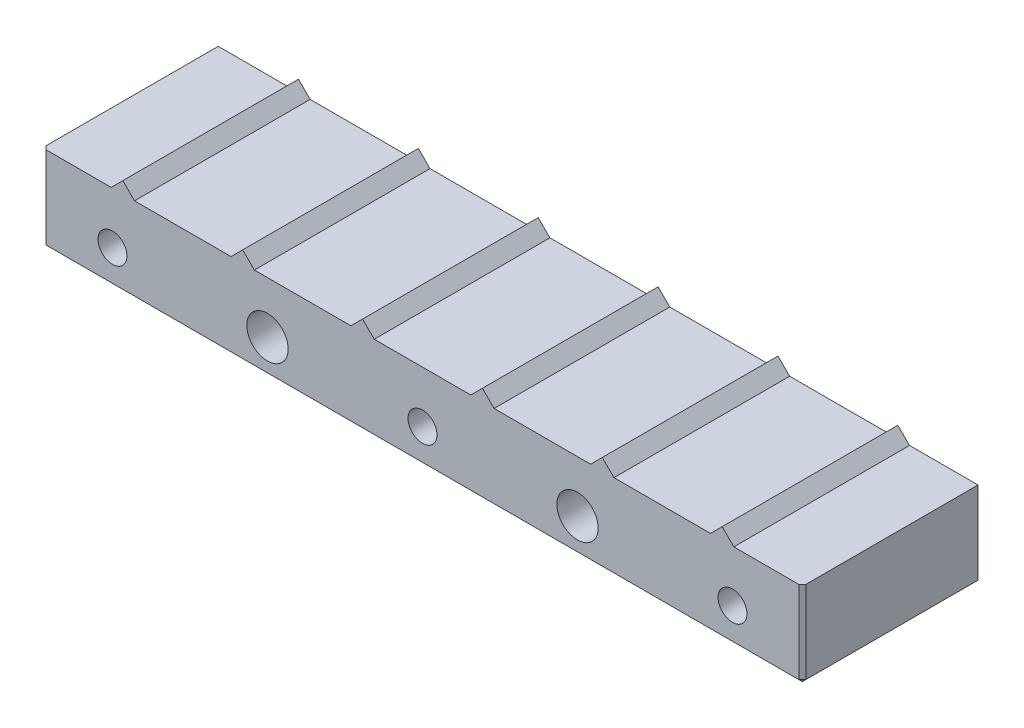
ISO-10303-21;
HEADER;
FILE_DESCRIPTION(('STEP AP214'),'2;1');
FILE_NAME('part.step','',(''),(''),'','','');
FILE_SCHEMA(('AUTOMOTIVE_DESIGN { 1 0 10303 214 1 1 1 1 }'));
ENDSEC;
DATA;
#1=APPLICATION_CONTEXT('core data for automotive mechanical design processes');
#2=APPLICATION_PROTOCOL_DEFINITION('international standard','automotive_design',2000,#1);
#3=PRODUCT_CONTEXT('',#1,'mechanical');
#4=PRODUCT('Part','Part','',(#3));
#5=PRODUCT_RELATED_PRODUCT_CATEGORY('part','',(#4));
#6=PRODUCT_DEFINITION_FORMATION('','',#4);
#7=PRODUCT_DEFINITION_CONTEXT('part definition',#1,'design');
#8=PRODUCT_DEFINITION('design','',#6,#7);
#9=PRODUCT_DEFINITION_SHAPE('','',#8);
#10=(LENGTH_UNIT() NAMED_UNIT(*) SI_UNIT(.MILLI.,.METRE.));
#11=(NAMED_UNIT(*) PLANE_ANGLE_UNIT() SI_UNIT($,.RADIAN.));
#12=(NAMED_UNIT(*) SI_UNIT($,.STERADIAN.) SOLID_ANGLE_UNIT());
#13=UNCERTAINTY_MEASURE_WITH_UNIT(LENGTH_MEASURE(1.E-05),#10,'distance_accuracy_value','');
#14=(GEOMETRIC_REPRESENTATION_CONTEXT(3) GLOBAL_UNCERTAINTY_ASSIGNED_CONTEXT((#13)) GLOBAL_UNIT_ASSIGNED_CONTEXT((#10,
#11,#12)) REPRESENTATION_CONTEXT('',''));
#15=CARTESIAN_POINT('',(0.,0.,0.));
#16=DIRECTION('',(0.,0.,1.));
#17=DIRECTION('',(1.,0.,0.));
#18=AXIS2_PLACEMENT_3D('',#15,#16,#17);
#19=CARTESIAN_POINT('',(9.95621320343559,12.475,-25.5));
#20=DIRECTION('',(0.70710678118633,-0.707106781186765,0.));
#21=DIRECTION('',(0.707106781186765,0.70710678118633,0.));
#22=AXIS2_PLACEMENT_3D('',#19,#20,#21);
#23=PLANE('',#22);
#24=DIRECTION('',(0.707106781186765,0.70710678118633,0.));
#25=VECTOR('',#24,1.);
#26=CARTESIAN_POINT('',(9.95621320343559,12.475,0.));
#27=LINE('',#26,#25);
#28=CARTESIAN_POINT('',(9.95621320343559,12.475,0.));
#29=VERTEX_POINT('',#28);
#30=CARTESIAN_POINT('',(11.6500000000008,14.1687867965642,0.));
#31=VERTEX_POINT('',#30);
#32=EDGE_CURVE('E245',#29,#31,#27,.T.);
#33=ORIENTED_EDGE('',*,*,#32,.T.);
#34=DIRECTION('',(0.,0.,1.));
#35=VECTOR('',#34,1.);
#36=CARTESIAN_POINT('',(11.6500000000008,14.1687867965642,-25.5));
#37=LINE('',#36,#35);
#38=CARTESIAN_POINT('',(11.6500000000008,14.1687867965642,-25.5));
#39=VERTEX_POINT('',#38);
#40=EDGE_CURVE('E226',#39,#31,#37,.T.);
#41=ORIENTED_EDGE('',*,*,#40,.F.);
#42=DIRECTION('',(0.707106781186765,0.70710678118633,0.));
#43=VECTOR('',#42,1.);
#44=CARTESIAN_POINT('',(9.95621320343559,12.475,-25.5));
#45=LINE('',#44,#43);
#46=CARTESIAN_POINT('',(9.95621320343559,12.475,-25.5));
#47=VERTEX_POINT('',#46);
#48=EDGE_CURVE('E233',#47,#39,#45,.T.);
#49=ORIENTED_EDGE('',*,*,#48,.F.);
#50=DIRECTION('',(0.,0.,1.));
#51=VECTOR('',#50,1.);
#52=CARTESIAN_POINT('',(9.95621320343559,12.475,-25.5));
#53=LINE('',#52,#51);
#54=EDGE_CURVE('E367',#47,#29,#53,.T.);
#55=ORIENTED_EDGE('',*,*,#54,.T.);
#56=EDGE_LOOP('',(#33,#41,#49,#55));
#57=FACE_BOUND('',#56,.T.);
#58=ADVANCED_FACE('F49',(#57),#23,.F.);
#59=CARTESIAN_POINT('',(11.6500000000008,14.1687867965642,-25.5));
#60=DIRECTION('',(-0.70710678118633,-0.707106781186765,0.));
#61=DIRECTION('',(0.707106781186765,-0.70710678118633,0.));
#62=AXIS2_PLACEMENT_3D('',#59,#60,#61);
#63=PLANE('',#62);
#64=DIRECTION('',(0.707106781186765,-0.70710678118633,0.));
#65=VECTOR('',#64,1.);
#66=CARTESIAN_POINT('',(11.6500000000008,14.1687867965642,0.));
#67=LINE('',#66,#65);
#68=CARTESIAN_POINT('',(13.343786796566,12.475,0.));
#69=VERTEX_POINT('',#68);
#70=EDGE_CURVE('E369',#31,#69,#67,.T.);
#71=ORIENTED_EDGE('',*,*,#70,.T.);
#72=DIRECTION('',(0.,0.,1.));
#73=VECTOR('',#72,1.);
#74=CARTESIAN_POINT('',(13.343786796566,12.475,-25.5));
#75=LINE('',#74,#73);
#76=CARTESIAN_POINT('',(13.343786796566,12.475,-25.5));
#77=VERTEX_POINT('',#76);
#78=EDGE_CURVE('E229',#77,#69,#75,.T.);
#79=ORIENTED_EDGE('',*,*,#78,.F.);
#80=DIRECTION('',(0.707106781186765,-0.70710678118633,0.));
#81=VECTOR('',#80,1.);
#82=CARTESIAN_POINT('',(11.6500000000008,14.1687867965642,-25.5));
#83=LINE('',#82,#81);
#84=EDGE_CURVE('E222',#39,#77,#83,.T.);
#85=ORIENTED_EDGE('',*,*,#84,.F.);
#86=ORIENTED_EDGE('',*,*,#40,.T.);
#87=EDGE_LOOP('',(#71,#79,#85,#86));
#88=FACE_BOUND('',#87,.T.);
#89=ADVANCED_FACE('F224',(#88),#63,.F.);
#90=CARTESIAN_POINT('',(13.343786796566,12.475,-25.5));
#91=DIRECTION('',(0.,-1.,0.));
#92=DIRECTION('',(0.,0.,-1.));
#93=AXIS2_PLACEMENT_3D('',#90,#91,#92);
#94=PLANE('',#93);
#95=DIRECTION('',(1.,0.,0.));
#96=VECTOR('',#95,1.);
#97=CARTESIAN_POINT('',(13.343786796566,12.475,0.));
#98=LINE('',#97,#96);
#99=CARTESIAN_POINT('',(27.356213203437,12.475,0.));
#100=VERTEX_POINT('',#99);
#101=EDGE_CURVE('E371',#69,#100,#98,.T.);
#102=ORIENTED_EDGE('',*,*,#101,.T.);
#103=DIRECTION('',(0.,0.,1.));
#104=VECTOR('',#103,1.);
#105=CARTESIAN_POINT('',(27.356213203437,12.475,-25.5));
#106=LINE('',#105,#104);
#107=CARTESIAN_POINT('',(27.356213203437,12.475,-25.5));
#108=VERTEX_POINT('',#107);
#109=EDGE_CURVE('E250',#108,#100,#106,.T.);
#110=ORIENTED_EDGE('',*,*,#109,.F.);
#111=DIRECTION('',(1.,0.,0.));
#112=VECTOR('',#111,1.);
#113=CARTESIAN_POINT('',(13.343786796566,12.475,-25.5));
#114=LINE('',#113,#112);
#115=EDGE_CURVE('E232',#77,#108,#114,.T.);
#116=ORIENTED_EDGE('',*,*,#115,.F.);
#117=ORIENTED_EDGE('',*,*,#78,.T.);
#118=EDGE_LOOP('',(#102,#110,#116,#117));
#119=FACE_BOUND('',#118,.T.);
#120=ADVANCED_FACE('F476',(#119),#94,.F.);
#121=CARTESIAN_POINT('',(27.356213203437,12.475,-25.5));
#122=DIRECTION('',(0.70710678118633,-0.707106781186765,0.));
#123=DIRECTION('',(0.707106781186765,0.70710678118633,0.));
#124=AXIS2_PLACEMENT_3D('',#121,#122,#123);
#125=PLANE('',#124);
#126=DIRECTION('',(0.707106781186765,0.70710678118633,0.));
#127=VECTOR('',#126,1.);
#128=CARTESIAN_POINT('',(27.356213203437,12.475,0.));
#129=LINE('',#128,#127);
#130=CARTESIAN_POINT('',(29.0500000000022,14.1687867965642,0.));
#131=VERTEX_POINT('',#130);
#132=EDGE_CURVE('E373',#100,#131,#129,.T.);
#133=ORIENTED_EDGE('',*,*,#132,.T.);
#134=DIRECTION('',(0.,0.,1.));
#135=VECTOR('',#134,1.);
#136=CARTESIAN_POINT('',(29.0500000000022,14.1687867965642,-25.5));
#137=LINE('',#136,#135);
#138=CARTESIAN_POINT('',(29.0500000000022,14.1687867965642,-25.5));
#139=VERTEX_POINT('',#138);
#140=EDGE_CURVE('E451',#139,#131,#137,.T.);
#141=ORIENTED_EDGE('',*,*,#140,.F.);
#142=DIRECTION('',(0.707106781186765,0.70710678118633,0.));
#143=VECTOR('',#142,1.);
#144=CARTESIAN_POINT('',(27.356213203437,12.475,-25.5));
#145=LINE('',#144,#143);
#146=EDGE_CURVE('E332',#108,#139,#145,.T.);
#147=ORIENTED_EDGE('',*,*,#146,.F.);
#148=ORIENTED_EDGE('',*,*,#109,.T.);
#149=EDGE_LOOP('',(#133,#141,#147,#148));
#150=FACE_BOUND('',#149,.T.);
#151=ADVANCED_FACE('F458',(#150),#125,.F.);
#152=CARTESIAN_POINT('',(29.0500000000022,14.1687867965642,-25.5));
#153=DIRECTION('',(-0.70710678118633,-0.707106781186765,0.));
#154=DIRECTION('',(0.707106781186765,-0.70710678118633,0.));
#155=AXIS2_PLACEMENT_3D('',#152,#153,#154);
#156=PLANE('',#155);
#157=DIRECTION('',(0.707106781186765,-0.70710678118633,0.));
#158=VECTOR('',#157,1.);
#159=CARTESIAN_POINT('',(29.0500000000022,14.1687867965642,0.));
#160=LINE('',#159,#158);
#161=CARTESIAN_POINT('',(30.7437867965674,12.475,0.));
#162=VERTEX_POINT('',#161);
#163=EDGE_CURVE('E375',#131,#162,#160,.T.);
#164=ORIENTED_EDGE('',*,*,#163,.T.);
#165=DIRECTION('',(0.,0.,1.));
#166=VECTOR('',#165,1.);
#167=CARTESIAN_POINT('',(30.7437867965674,12.475,-25.5));
#168=LINE('',#167,#166);
#169=CARTESIAN_POINT('',(30.7437867965674,12.475,-25.5));
#170=VERTEX_POINT('',#169);
#171=EDGE_CURVE('E448',#170,#162,#168,.T.);
#172=ORIENTED_EDGE('',*,*,#171,.F.);
#173=DIRECTION('',(0.707106781186765,-0.70710678118633,0.));
#174=VECTOR('',#173,1.);
#175=CARTESIAN_POINT('',(29.0500000000022,14.1687867965642,-25.5));
#176=LINE('',#175,#174);
#177=EDGE_CURVE('E334',#139,#170,#176,.T.);
#178=ORIENTED_EDGE('',*,*,#177,.F.);
#179=ORIENTED_EDGE('',*,*,#140,.T.);
#180=EDGE_LOOP('',(#164,#172,#178,#179));
#181=FACE_BOUND('',#180,.T.);
#182=ADVANCED_FACE('F468',(#181),#156,.F.);
#183=CARTESIAN_POINT('',(30.7437867965674,12.475,-25.5));
#184=DIRECTION('',(0.,-1.,0.));
#185=DIRECTION('',(0.,0.,-1.));
#186=AXIS2_PLACEMENT_3D('',#183,#184,#185);
#187=PLANE('',#186);
#188=DIRECTION('',(1.,0.,0.));
#189=VECTOR('',#188,1.);
#190=CARTESIAN_POINT('',(30.7437867965674,12.475,0.));
#191=LINE('',#190,#189);
#192=CARTESIAN_POINT('',(44.7562132034383,12.475,0.));
#193=VERTEX_POINT('',#192);
#194=EDGE_CURVE('E377',#162,#193,#191,.T.);
#195=ORIENTED_EDGE('',*,*,#194,.T.);
#196=DIRECTION('',(0.,0.,1.));
#197=VECTOR('',#196,1.);
#198=CARTESIAN_POINT('',(44.7562132034383,12.475,-25.5));
#199=LINE('',#198,#197);
#200=CARTESIAN_POINT('',(44.7562132034383,12.475,-25.5));
#201=VERTEX_POINT('',#200);
#202=EDGE_CURVE('E445',#201,#193,#199,.T.);
#203=ORIENTED_EDGE('',*,*,#202,.F.);
#204=DIRECTION('',(1.,0.,0.));
#205=VECTOR('',#204,1.);
#206=CARTESIAN_POINT('',(30.7437867965674,12.475,-25.5));
#207=LINE('',#206,#205);
#208=EDGE_CURVE('E336',#170,#201,#207,.T.);
#209=ORIENTED_EDGE('',*,*,#208,.F.);
#210=ORIENTED_EDGE('',*,*,#171,.T.);
#211=EDGE_LOOP('',(#195,#203,#209,#210));
#212=FACE_BOUND('',#211,.T.);
#213=ADVANCED_FACE('F472',(#212),#187,.F.);
#214=CARTESIAN_POINT('',(44.7562132034383,12.475,-25.5));
#215=DIRECTION('',(0.70710678118633,-0.707106781186765,0.));
#216=DIRECTION('',(0.707106781186765,0.70710678118633,0.));
#217=AXIS2_PLACEMENT_3D('',#214,#215,#216);
#218=PLANE('',#217);
#219=DIRECTION('',(0.707106781186765,0.70710678118633,0.));
#220=VECTOR('',#219,1.);
#221=CARTESIAN_POINT('',(44.7562132034383,12.475,0.));
#222=LINE('',#221,#220);
#223=CARTESIAN_POINT('',(46.4500000000035,14.1687867965642,0.));
#224=VERTEX_POINT('',#223);
#225=EDGE_CURVE('E379',#193,#224,#222,.T.);
#226=ORIENTED_EDGE('',*,*,#225,.T.);
#227=DIRECTION('',(0.,0.,1.));
#228=VECTOR('',#227,1.);
#229=CARTESIAN_POINT('',(46.4500000000035,14.1687867965642,-25.5));
#230=LINE('',#229,#228);
#231=CARTESIAN_POINT('',(46.4500000000035,14.1687867965642,-25.5));
#232=VERTEX_POINT('',#231);
#233=EDGE_CURVE('E442',#232,#224,#230,.T.);
#234=ORIENTED_EDGE('',*,*,#233,.F.);
#235=DIRECTION('',(0.707106781186765,0.70710678118633,0.));
#236=VECTOR('',#235,1.);
#237=CARTESIAN_POINT('',(44.7562132034383,12.475,-25.5));
#238=LINE('',#237,#236);
#239=EDGE_CURVE('E338',#201,#232,#238,.T.);
#240=ORIENTED_EDGE('',*,*,#239,.F.);
#241=ORIENTED_EDGE('',*,*,#202,.T.);
#242=EDGE_LOOP('',(#226,#234,#240,#241));
#243=FACE_BOUND('',#242,.T.);
#244=ADVANCED_FACE('F583',(#243),#218,.F.);
#245=CARTESIAN_POINT('',(46.4500000000035,14.1687867965642,-25.5));
#246=DIRECTION('',(-0.70710678118633,-0.707106781186765,0.));
#247=DIRECTION('',(0.707106781186765,-0.70710678118633,0.));
#248=AXIS2_PLACEMENT_3D('',#245,#246,#247);
#249=PLANE('',#248);
#250=DIRECTION('',(0.707106781186765,-0.70710678118633,0.));
#251=VECTOR('',#250,1.);
#252=CARTESIAN_POINT('',(46.4500000000035,14.1687867965642,0.));
#253=LINE('',#252,#251);
#254=CARTESIAN_POINT('',(48.1437867965688,12.475,0.));
#255=VERTEX_POINT('',#254);
#256=EDGE_CURVE('E381',#224,#255,#253,.T.);
#257=ORIENTED_EDGE('',*,*,#256,.T.);
#258=DIRECTION('',(0.,0.,1.));
#259=VECTOR('',#258,1.);
#260=CARTESIAN_POINT('',(48.1437867965688,12.475,-25.5));
#261=LINE('',#260,#259);
#262=CARTESIAN_POINT('',(48.1437867965688,12.475,-25.5));
#263=VERTEX_POINT('',#262);
#264=EDGE_CURVE('E439',#263,#255,#261,.T.);
#265=ORIENTED_EDGE('',*,*,#264,.F.);
#266=DIRECTION('',(0.707106781186765,-0.70710678118633,0.));
#267=VECTOR('',#266,1.);
#268=CARTESIAN_POINT('',(46.4500000000035,14.1687867965642,-25.5));
#269=LINE('',#268,#267);
#270=EDGE_CURVE('E340',#232,#263,#269,.T.);
#271=ORIENTED_EDGE('',*,*,#270,.F.);
#272=ORIENTED_EDGE('',*,*,#233,.T.);
#273=EDGE_LOOP('',(#257,#265,#271,#272));
#274=FACE_BOUND('',#273,.T.);
#275=ADVANCED_FACE('F581',(#274),#249,.F.);
#276=CARTESIAN_POINT('',(48.1437867965688,12.475,-25.5));
#277=DIRECTION('',(0.,-1.,0.));
#278=DIRECTION('',(1.,0.,0.));
#279=AXIS2_PLACEMENT_3D('',#276,#277,#278);
#280=PLANE('',#279);
#281=DIRECTION('',(1.,0.,0.));
#282=VECTOR('',#281,1.);
#283=CARTESIAN_POINT('',(48.1437867965688,12.475,0.));
#284=LINE('',#283,#282);
#285=CARTESIAN_POINT('',(62.1562132034397,12.475,0.));
#286=VERTEX_POINT('',#285);
#287=EDGE_CURVE('E383',#255,#286,#284,.T.);
#288=ORIENTED_EDGE('',*,*,#287,.T.);
#289=DIRECTION('',(0.,0.,1.));
#290=VECTOR('',#289,1.);
#291=CARTESIAN_POINT('',(62.1562132034397,12.475,-25.5));
#292=LINE('',#291,#290);
#293=CARTESIAN_POINT('',(62.1562132034397,12.475,-25.5));
#294=VERTEX_POINT('',#293);
#295=EDGE_CURVE('E436',#294,#286,#292,.T.);
#296=ORIENTED_EDGE('',*,*,#295,.F.);
#297=DIRECTION('',(1.,0.,0.));
#298=VECTOR('',#297,1.);
#299=CARTESIAN_POINT('',(48.1437867965688,12.475,-25.5));
#300=LINE('',#299,#298);
#301=EDGE_CURVE('E342',#263,#294,#300,.T.);
#302=ORIENTED_EDGE('',*,*,#301,.F.);
#303=ORIENTED_EDGE('',*,*,#264,.T.);
#304=EDGE_LOOP('',(#288,#296,#302,#303));
#305=FACE_BOUND('',#304,.T.);
#306=ADVANCED_FACE('F577',(#305),#280,.F.);
#307=CARTESIAN_POINT('',(62.1562132034397,12.475,-25.5));
#308=DIRECTION('',(0.707106781186331,-0.707106781186764,0.));
#309=DIRECTION('',(0.707106781186764,0.707106781186331,0.));
#310=AXIS2_PLACEMENT_3D('',#307,#308,#309);
#311=PLANE('',#310);
#312=DIRECTION('',(0.707106781186764,0.707106781186331,0.));
#313=VECTOR('',#312,1.);
#314=CARTESIAN_POINT('',(62.1562132034397,12.475,0.));
#315=LINE('',#314,#313);
#316=CARTESIAN_POINT('',(63.8500000000049,14.1687867965642,0.));
#317=VERTEX_POINT('',#316);
#318=EDGE_CURVE('E385',#286,#317,#315,.T.);
#319=ORIENTED_EDGE('',*,*,#318,.T.);
#320=DIRECTION('',(0.,0.,1.));
#321=VECTOR('',#320,1.);
#322=CARTESIAN_POINT('',(63.8500000000049,14.1687867965642,-25.5));
#323=LINE('',#322,#321);
#324=CARTESIAN_POINT('',(63.8500000000049,14.1687867965642,-25.5));
#325=VERTEX_POINT('',#324);
#326=EDGE_CURVE('E433',#325,#317,#323,.T.);
#327=ORIENTED_EDGE('',*,*,#326,.F.);
#328=DIRECTION('',(0.707106781186764,0.707106781186331,0.));
#329=VECTOR('',#328,1.);
#330=CARTESIAN_POINT('',(62.1562132034397,12.475,-25.5));
#331=LINE('',#330,#329);
#332=EDGE_CURVE('E344',#294,#325,#331,.T.);
#333=ORIENTED_EDGE('',*,*,#332,.F.);
#334=ORIENTED_EDGE('',*,*,#295,.T.);
#335=EDGE_LOOP('',(#319,#327,#333,#334));
#336=FACE_BOUND('',#335,.T.);
#337=ADVANCED_FACE('F572',(#336),#311,.F.);
#338=CARTESIAN_POINT('',(63.8500000000049,14.1687867965642,-25.5));
#339=DIRECTION('',(-0.70710678118633,-0.707106781186765,0.));
#340=DIRECTION('',(0.707106781186765,-0.70710678118633,0.));
#341=AXIS2_PLACEMENT_3D('',#338,#339,#340);
#342=PLANE('',#341);
#343=DIRECTION('',(0.707106781186765,-0.70710678118633,0.));
#344=VECTOR('',#343,1.);
#345=CARTESIAN_POINT('',(63.8500000000049,14.1687867965642,0.));
#346=LINE('',#345,#344);
#347=CARTESIAN_POINT('',(65.5437867965701,12.475,0.));
#348=VERTEX_POINT('',#347);
#349=EDGE_CURVE('E387',#317,#348,#346,.T.);
#350=ORIENTED_EDGE('',*,*,#349,.T.);
#351=DIRECTION('',(0.,0.,1.));
#352=VECTOR('',#351,1.);
#353=CARTESIAN_POINT('',(65.5437867965701,12.475,-25.5));
#354=LINE('',#353,#352);
#355=CARTESIAN_POINT('',(65.5437867965701,12.475,-25.5));
#356=VERTEX_POINT('',#355);
#357=EDGE_CURVE('E430',#356,#348,#354,.T.);
#358=ORIENTED_EDGE('',*,*,#357,.F.);
#359=DIRECTION('',(0.707106781186765,-0.70710678118633,0.));
#360=VECTOR('',#359,1.);
#361=CARTESIAN_POINT('',(63.8500000000049,14.1687867965642,-25.5));
#362=LINE('',#361,#360);
#363=EDGE_CURVE('E346',#325,#356,#362,.T.);
#364=ORIENTED_EDGE('',*,*,#363,.F.);
#365=ORIENTED_EDGE('',*,*,#326,.T.);
#366=EDGE_LOOP('',(#350,#358,#364,#365));
#367=FACE_BOUND('',#366,.T.);
#368=ADVANCED_FACE('F566',(#367),#342,.F.);
#369=CARTESIAN_POINT('',(65.5437867965701,12.475,-25.5));
#370=DIRECTION('',(0.,-1.,0.));
#371=DIRECTION('',(1.,0.,0.));
#372=AXIS2_PLACEMENT_3D('',#369,#370,#371);
#373=PLANE('',#372);
#374=DIRECTION('',(1.,0.,0.));
#375=VECTOR('',#374,1.);
#376=CARTESIAN_POINT('',(65.5437867965701,12.475,0.));
#377=LINE('',#376,#375);
#378=CARTESIAN_POINT('',(79.5562132034411,12.475,0.));
#379=VERTEX_POINT('',#378);
#380=EDGE_CURVE('E389',#348,#379,#377,.T.);
#381=ORIENTED_EDGE('',*,*,#380,.T.);
#382=DIRECTION('',(0.,0.,1.));
#383=VECTOR('',#382,1.);
#384=CARTESIAN_POINT('',(79.5562132034411,12.475,-25.5));
#385=LINE('',#384,#383);
#386=CARTESIAN_POINT('',(79.5562132034411,12.475,-25.5));
#387=VERTEX_POINT('',#386);
#388=EDGE_CURVE('E427',#387,#379,#385,.T.);
#389=ORIENTED_EDGE('',*,*,#388,.F.);
#390=DIRECTION('',(1.,0.,0.));
#391=VECTOR('',#390,1.);
#392=CARTESIAN_POINT('',(65.5437867965701,12.475,-25.5));
#393=LINE('',#392,#391);
#394=EDGE_CURVE('E348',#356,#387,#393,.T.);
#395=ORIENTED_EDGE('',*,*,#394,.F.);
#396=ORIENTED_EDGE('',*,*,#357,.T.);
#397=EDGE_LOOP('',(#381,#389,#395,#396));
#398=FACE_BOUND('',#397,.T.);
#399=ADVANCED_FACE('F562',(#398),#373,.F.);
#400=CARTESIAN_POINT('',(79.5562132034411,12.475,-25.5));
#401=DIRECTION('',(0.707106781186331,-0.707106781186764,0.));
#402=DIRECTION('',(0.707106781186764,0.707106781186331,0.));
#403=AXIS2_PLACEMENT_3D('',#400,#401,#402);
#404=PLANE('',#403);
#405=DIRECTION('',(0.707106781186764,0.707106781186331,0.));
#406=VECTOR('',#405,1.);
#407=CARTESIAN_POINT('',(79.5562132034411,12.475,0.));
#408=LINE('',#407,#406);
#409=CARTESIAN_POINT('',(81.2500000000063,14.1687867965642,0.));
#410=VERTEX_POINT('',#409);
#411=EDGE_CURVE('E391',#379,#410,#408,.T.);
#412=ORIENTED_EDGE('',*,*,#411,.T.);
#413=DIRECTION('',(0.,0.,1.));
#414=VECTOR('',#413,1.);
#415=CARTESIAN_POINT('',(81.2500000000063,14.1687867965642,-25.5));
#416=LINE('',#415,#414);
#417=CARTESIAN_POINT('',(81.2500000000063,14.1687867965642,-25.5));
#418=VERTEX_POINT('',#417);
#419=EDGE_CURVE('E424',#418,#410,#416,.T.);
#420=ORIENTED_EDGE('',*,*,#419,.F.);
#421=DIRECTION('',(0.707106781186764,0.707106781186331,0.));
#422=VECTOR('',#421,1.);
#423=CARTESIAN_POINT('',(79.5562132034411,12.475,-25.5));
#424=LINE('',#423,#422);
#425=EDGE_CURVE('E350',#387,#418,#424,.T.);
#426=ORIENTED_EDGE('',*,*,#425,.F.);
#427=ORIENTED_EDGE('',*,*,#388,.T.);
#428=EDGE_LOOP('',(#412,#420,#426,#427));
#429=FACE_BOUND('',#428,.T.);
#430=ADVANCED_FACE('F557',(#429),#404,.F.);
#431=CARTESIAN_POINT('',(81.2500000000063,14.1687867965642,-25.5));
#432=DIRECTION('',(-0.70710678118633,-0.707106781186765,0.));
#433=DIRECTION('',(0.707106781186765,-0.70710678118633,0.));
#434=AXIS2_PLACEMENT_3D('',#431,#432,#433);
#435=PLANE('',#434);
#436=DIRECTION('',(0.707106781186765,-0.70710678118633,0.));
#437=VECTOR('',#436,1.);
#438=CARTESIAN_POINT('',(81.2500000000063,14.1687867965642,0.));
#439=LINE('',#438,#437);
#440=CARTESIAN_POINT('',(82.9437867965715,12.475,0.));
#441=VERTEX_POINT('',#440);
#442=EDGE_CURVE('E393',#410,#441,#439,.T.);
#443=ORIENTED_EDGE('',*,*,#442,.T.);
#444=DIRECTION('',(0.,0.,1.));
#445=VECTOR('',#444,1.);
#446=CARTESIAN_POINT('',(82.9437867965715,12.475,-25.5));
#447=LINE('',#446,#445);
#448=CARTESIAN_POINT('',(82.9437867965715,12.475,-25.5));
#449=VERTEX_POINT('',#448);
#450=EDGE_CURVE('E421',#449,#441,#447,.T.);
#451=ORIENTED_EDGE('',*,*,#450,.F.);
#452=DIRECTION('',(0.707106781186765,-0.70710678118633,0.));
#453=VECTOR('',#452,1.);
#454=CARTESIAN_POINT('',(81.2500000000063,14.1687867965642,-25.5));
#455=LINE('',#454,#453);
#456=EDGE_CURVE('E352',#418,#449,#455,.T.);
#457=ORIENTED_EDGE('',*,*,#456,.F.);
#458=ORIENTED_EDGE('',*,*,#419,.T.);
#459=EDGE_LOOP('',(#443,#451,#457,#458));
#460=FACE_BOUND('',#459,.T.);
#461=ADVANCED_FACE('F551',(#460),#435,.F.);
#462=CARTESIAN_POINT('',(82.9437867965715,12.475,-25.5));
#463=DIRECTION('',(0.,-1.,0.));
#464=DIRECTION('',(1.,0.,0.));
#465=AXIS2_PLACEMENT_3D('',#462,#463,#464);
#466=PLANE('',#465);
#467=DIRECTION('',(1.,0.,0.));
#468=VECTOR('',#467,1.);
#469=CARTESIAN_POINT('',(82.9437867965715,12.475,0.));
#470=LINE('',#469,#468);
#471=CARTESIAN_POINT('',(96.9562132034424,12.475,0.));
#472=VERTEX_POINT('',#471);
#473=EDGE_CURVE('E395',#441,#472,#470,.T.);
#474=ORIENTED_EDGE('',*,*,#473,.T.);
#475=DIRECTION('',(0.,0.,1.));
#476=VECTOR('',#475,1.);
#477=CARTESIAN_POINT('',(96.9562132034424,12.475,-25.5));
#478=LINE('',#477,#476);
#479=CARTESIAN_POINT('',(96.9562132034424,12.475,-25.5));
#480=VERTEX_POINT('',#479);
#481=EDGE_CURVE('E418',#480,#472,#478,.T.);
#482=ORIENTED_EDGE('',*,*,#481,.F.);
#483=DIRECTION('',(1.,0.,0.));
#484=VECTOR('',#483,1.);
#485=CARTESIAN_POINT('',(82.9437867965715,12.475,-25.5));
#486=LINE('',#485,#484);
#487=EDGE_CURVE('E354',#449,#480,#486,.T.);
#488=ORIENTED_EDGE('',*,*,#487,.F.);
#489=ORIENTED_EDGE('',*,*,#450,.T.);
#490=EDGE_LOOP('',(#474,#482,#488,#489));
#491=FACE_BOUND('',#490,.T.);
#492=ADVANCED_FACE('F547',(#491),#466,.F.);
#493=CARTESIAN_POINT('',(96.9562132034424,12.475,-25.5));
#494=DIRECTION('',(0.70710678118633,-0.707106781186765,0.));
#495=DIRECTION('',(0.707106781186765,0.70710678118633,0.));
#496=AXIS2_PLACEMENT_3D('',#493,#494,#495);
#497=PLANE('',#496);
#498=DIRECTION('',(0.707106781186765,0.70710678118633,0.));
#499=VECTOR('',#498,1.);
#500=CARTESIAN_POINT('',(96.9562132034424,12.475,0.));
#501=LINE('',#500,#499);
#502=CARTESIAN_POINT('',(98.6500000000076,14.1687867965642,0.));
#503=VERTEX_POINT('',#502);
#504=EDGE_CURVE('E397',#472,#503,#501,.T.);
#505=ORIENTED_EDGE('',*,*,#504,.T.);
#506=DIRECTION('',(0.,0.,1.));
#507=VECTOR('',#506,1.);
#508=CARTESIAN_POINT('',(98.6500000000076,14.1687867965642,-25.5));
#509=LINE('',#508,#507);
#510=CARTESIAN_POINT('',(98.6500000000076,14.1687867965642,-25.5));
#511=VERTEX_POINT('',#510);
#512=EDGE_CURVE('E415',#511,#503,#509,.T.);
#513=ORIENTED_EDGE('',*,*,#512,.F.);
#514=DIRECTION('',(0.707106781186765,0.70710678118633,0.));
#515=VECTOR('',#514,1.);
#516=CARTESIAN_POINT('',(96.9562132034424,12.475,-25.5));
#517=LINE('',#516,#515);
#518=EDGE_CURVE('E356',#480,#511,#517,.T.);
#519=ORIENTED_EDGE('',*,*,#518,.F.);
#520=ORIENTED_EDGE('',*,*,#481,.T.);
#521=EDGE_LOOP('',(#505,#513,#519,#520));
#522=FACE_BOUND('',#521,.T.);
#523=ADVANCED_FACE('F542',(#522),#497,.F.);
#524=CARTESIAN_POINT('',(98.6500000000076,14.1687867965642,-25.5));
#525=DIRECTION('',(-0.70710678118633,-0.707106781186765,0.));
#526=DIRECTION('',(0.707106781186765,-0.70710678118633,0.));
#527=AXIS2_PLACEMENT_3D('',#524,#525,#526);
#528=PLANE('',#527);
#529=DIRECTION('',(0.707106781186765,-0.70710678118633,0.));
#530=VECTOR('',#529,1.);
#531=CARTESIAN_POINT('',(98.6500000000076,14.1687867965642,0.));
#532=LINE('',#531,#530);
#533=CARTESIAN_POINT('',(100.343786796573,12.475,0.));
#534=VERTEX_POINT('',#533);
#535=EDGE_CURVE('E399',#503,#534,#532,.T.);
#536=ORIENTED_EDGE('',*,*,#535,.T.);
#537=DIRECTION('',(0.,0.,1.));
#538=VECTOR('',#537,1.);
#539=CARTESIAN_POINT('',(100.343786796573,12.475,-25.5));
#540=LINE('',#539,#538);
#541=CARTESIAN_POINT('',(100.343786796573,12.475,-25.5));
#542=VERTEX_POINT('',#541);
#543=EDGE_CURVE('E412',#542,#534,#540,.T.);
#544=ORIENTED_EDGE('',*,*,#543,.F.);
#545=DIRECTION('',(0.707106781186765,-0.70710678118633,0.));
#546=VECTOR('',#545,1.);
#547=CARTESIAN_POINT('',(98.6500000000076,14.1687867965642,-25.5));
#548=LINE('',#547,#546);
#549=EDGE_CURVE('E358',#511,#542,#548,.T.);
#550=ORIENTED_EDGE('',*,*,#549,.F.);
#551=ORIENTED_EDGE('',*,*,#512,.T.);
#552=EDGE_LOOP('',(#536,#544,#550,#551));
#553=FACE_BOUND('',#552,.T.);
#554=ADVANCED_FACE('F536',(#553),#528,.F.);
#555=CARTESIAN_POINT('',(100.343786796573,12.475,-25.5));
#556=DIRECTION('',(0.,-1.,0.));
#557=DIRECTION('',(1.,0.,0.));
#558=AXIS2_PLACEMENT_3D('',#555,#556,#557);
#559=PLANE('',#558);
#560=DIRECTION('',(1.,0.,0.));
#561=VECTOR('',#560,1.);
#562=CARTESIAN_POINT('',(100.343786796573,12.475,0.));
#563=LINE('',#562,#561);
#564=CARTESIAN_POINT('',(109.785,12.475,0.));
#565=VERTEX_POINT('',#564);
#566=EDGE_CURVE('E401',#534,#565,#563,.T.);
#567=ORIENTED_EDGE('',*,*,#566,.T.);
#568=DIRECTION('',(-0.707106781186548,0.,0.707106781186548));
#569=VECTOR('',#568,1.);
#570=CARTESIAN_POINT('',(110.285,12.475,-0.5));
#571=LINE('',#570,#569);
#572=CARTESIAN_POINT('',(110.285,12.475,-0.500000000000007));
#573=VERTEX_POINT('',#572);
#574=EDGE_CURVE('E58',#565,#573,#571,.F.);
#575=ORIENTED_EDGE('',*,*,#574,.T.);
#576=DIRECTION('',(0.,0.,1.));
#577=VECTOR('',#576,1.);
#578=CARTESIAN_POINT('',(110.285,12.475,-25.5));
#579=LINE('',#578,#577);
#580=CARTESIAN_POINT('',(110.285,12.475,-25.5));
#581=VERTEX_POINT('',#580);
#582=EDGE_CURVE('E409',#581,#573,#579,.T.);
#583=ORIENTED_EDGE('',*,*,#582,.F.);
#584=DIRECTION('',(1.,0.,0.));
#585=VECTOR('',#584,1.);
#586=CARTESIAN_POINT('',(100.343786796573,12.475,-25.5));
#587=LINE('',#586,#585);
#588=EDGE_CURVE('E360',#542,#581,#587,.T.);
#589=ORIENTED_EDGE('',*,*,#588,.F.);
#590=ORIENTED_EDGE('',*,*,#543,.T.);
#591=EDGE_LOOP('',(#567,#575,#583,#589,#590));
#592=FACE_BOUND('',#591,.T.);
#593=ADVANCED_FACE('F530',(#592),#559,.F.);
#594=CARTESIAN_POINT('',(110.285,12.475,-25.5));
#595=DIRECTION('',(-1.,0.,0.));
#596=DIRECTION('',(0.,0.,1.));
#597=AXIS2_PLACEMENT_3D('',#594,#595,#596);
#598=PLANE('',#597);
#599=ORIENTED_EDGE('',*,*,#582,.T.);
#600=DIRECTION('',(0.,-1.,0.));
#601=VECTOR('',#600,1.);
#602=CARTESIAN_POINT('',(110.285,12.475,-0.5));
#603=LINE('',#602,#601);
#604=CARTESIAN_POINT('',(110.285,0.5,-0.5));
#605=VERTEX_POINT('',#604);
#606=EDGE_CURVE('E269',#573,#605,#603,.T.);
#607=ORIENTED_EDGE('',*,*,#606,.T.);
#608=DIRECTION('',(0.,0.,-1.));
#609=VECTOR('',#608,1.);
#610=CARTESIAN_POINT('',(110.285,0.5,-25.5));
#611=LINE('',#610,#609);
#612=CARTESIAN_POINT('',(110.285,0.5,-25.5));
#613=VERTEX_POINT('',#612);
#614=EDGE_CURVE('E267',#605,#613,#611,.T.);
#615=ORIENTED_EDGE('',*,*,#614,.T.);
#616=DIRECTION('',(0.,-1.,0.));
#617=VECTOR('',#616,1.);
#618=CARTESIAN_POINT('',(110.285,12.475,-25.5));
#619=LINE('',#618,#617);
#620=EDGE_CURVE('E362',#581,#613,#619,.T.);
#621=ORIENTED_EDGE('',*,*,#620,.F.);
#622=EDGE_LOOP('',(#599,#607,#615,#621));
#623=FACE_BOUND('',#622,.T.);
#624=ADVANCED_FACE('F669',(#623),#598,.F.);
#625=CARTESIAN_POINT('',(0.,0.,-25.5));
#626=DIRECTION('',(0.,-1.,0.));
#627=DIRECTION('',(0.,0.,-1.));
#628=AXIS2_PLACEMENT_3D('',#625,#626,#627);
#629=PLANE('',#628);
#630=DIRECTION('',(0.,0.,-1.));
#631=VECTOR('',#630,1.);
#632=CARTESIAN_POINT('',(0.5,0.,-25.5));
#633=LINE('',#632,#631);
#634=CARTESIAN_POINT('',(0.5,0.,-0.5));
#635=VERTEX_POINT('',#634);
#636=CARTESIAN_POINT('',(0.5,0.,-25.));
#637=VERTEX_POINT('',#636);
#638=EDGE_CURVE('E255',#635,#637,#633,.T.);
#639=ORIENTED_EDGE('',*,*,#638,.T.);
#640=DIRECTION('',(1.,0.,0.));
#641=VECTOR('',#640,1.);
#642=CARTESIAN_POINT('',(0.,0.,-25.));
#643=LINE('',#642,#641);
#644=CARTESIAN_POINT('',(109.785,0.,-25.));
#645=VERTEX_POINT('',#644);
#646=EDGE_CURVE('E257',#637,#645,#643,.T.);
#647=ORIENTED_EDGE('',*,*,#646,.T.);
#648=DIRECTION('',(0.,0.,1.));
#649=VECTOR('',#648,1.);
#650=CARTESIAN_POINT('',(109.785,0.,0.));
#651=LINE('',#650,#649);
#652=CARTESIAN_POINT('',(109.785,0.,-0.5));
#653=VERTEX_POINT('',#652);
#654=EDGE_CURVE('E248',#645,#653,#651,.T.);
#655=ORIENTED_EDGE('',*,*,#654,.T.);
#656=DIRECTION('',(-1.,0.,0.));
#657=VECTOR('',#656,1.);
#658=CARTESIAN_POINT('',(0.,0.,-0.5));
#659=LINE('',#658,#657);
#660=EDGE_CURVE('E246',#653,#635,#659,.T.);
#661=ORIENTED_EDGE('',*,*,#660,.T.);
#662=EDGE_LOOP('',(#639,#647,#655,#661));
#663=FACE_BOUND('',#662,.T.);
#664=ADVANCED_FACE('F676',(#663),#629,.T.);
#665=CARTESIAN_POINT('',(0.,0.,-25.5));
#666=DIRECTION('',(1.,0.,0.));
#667=DIRECTION('',(0.,0.,-1.));
#668=AXIS2_PLACEMENT_3D('',#665,#666,#667);
#669=PLANE('',#668);
#670=DIRECTION('',(0.,1.,0.));
#671=VECTOR('',#670,1.);
#672=CARTESIAN_POINT('',(0.,0.,-25.5));
#673=LINE('',#672,#671);
#674=CARTESIAN_POINT('',(0.,0.5,-25.5));
#675=VERTEX_POINT('',#674);
#676=CARTESIAN_POINT('',(0.,12.475,-25.5));
#677=VERTEX_POINT('',#676);
#678=EDGE_CURVE('E364',#675,#677,#673,.T.);
#679=ORIENTED_EDGE('',*,*,#678,.F.);
#680=DIRECTION('',(0.,0.,1.));
#681=VECTOR('',#680,1.);
#682=CARTESIAN_POINT('',(0.,0.5,0.));
#683=LINE('',#682,#681);
#684=CARTESIAN_POINT('',(0.,0.5,-0.5));
#685=VERTEX_POINT('',#684);
#686=EDGE_CURVE('E265',#675,#685,#683,.T.);
#687=ORIENTED_EDGE('',*,*,#686,.T.);
#688=DIRECTION('',(0.,1.,0.));
#689=VECTOR('',#688,1.);
#690=CARTESIAN_POINT('',(0.,0.,-0.5));
#691=LINE('',#690,#689);
#692=CARTESIAN_POINT('',(0.,12.475,-0.5));
#693=VERTEX_POINT('',#692);
#694=EDGE_CURVE('E263',#685,#693,#691,.T.);
#695=ORIENTED_EDGE('',*,*,#694,.T.);
#696=DIRECTION('',(0.,0.,1.));
#697=VECTOR('',#696,1.);
#698=CARTESIAN_POINT('',(0.,12.475,-25.5));
#699=LINE('',#698,#697);
#700=EDGE_CURVE('E406',#677,#693,#699,.T.);
#701=ORIENTED_EDGE('',*,*,#700,.F.);
#702=EDGE_LOOP('',(#679,#687,#695,#701));
#703=FACE_BOUND('',#702,.T.);
#704=ADVANCED_FACE('F684',(#703),#669,.F.);
#705=CARTESIAN_POINT('',(9.95621320343559,12.475,-25.5));
#706=DIRECTION('',(0.,1.,0.));
#707=DIRECTION('',(-1.,0.,0.));
#708=AXIS2_PLACEMENT_3D('',#705,#706,#707);
#709=PLANE('',#708);
#710=ORIENTED_EDGE('',*,*,#700,.T.);
#711=DIRECTION('',(-0.707106781186548,0.,-0.707106781186548));
#712=VECTOR('',#711,1.);
#713=CARTESIAN_POINT('',(-7.5218933982822,12.475,-8.0218933982822));
#714=LINE('',#713,#712);
#715=CARTESIAN_POINT('',(0.5,12.475,0.));
#716=VERTEX_POINT('',#715);
#717=EDGE_CURVE('E13',#693,#716,#714,.F.);
#718=ORIENTED_EDGE('',*,*,#717,.T.);
#719=DIRECTION('',(-1.,0.,0.));
#720=VECTOR('',#719,1.);
#721=CARTESIAN_POINT('',(9.95621320343559,12.475,0.));
#722=LINE('',#721,#720);
#723=EDGE_CURVE('E242',#29,#716,#722,.T.);
#724=ORIENTED_EDGE('',*,*,#723,.F.);
#725=ORIENTED_EDGE('',*,*,#54,.F.);
#726=DIRECTION('',(-1.,0.,0.));
#727=VECTOR('',#726,1.);
#728=CARTESIAN_POINT('',(9.95621320343559,12.475,-25.5));
#729=LINE('',#728,#727);
#730=EDGE_CURVE('E240',#47,#677,#729,.T.);
#731=ORIENTED_EDGE('',*,*,#730,.T.);
#732=EDGE_LOOP('',(#710,#718,#724,#725,#731));
#733=FACE_BOUND('',#732,.T.);
#734=ADVANCED_FACE('F692',(#733),#709,.T.);
#735=CARTESIAN_POINT('',(0.,0.,-25.5));
#736=DIRECTION('',(0.,0.,-1.));
#737=DIRECTION('',(-1.,0.,0.));
#738=AXIS2_PLACEMENT_3D('',#735,#736,#737);
#739=PLANE('',#738);
#740=CARTESIAN_POINT('',(32.6500000000023,4.99,-25.5));
#741=DIRECTION('',(0.,0.,1.));
#742=DIRECTION('',(1.,0.,0.));
#743=AXIS2_PLACEMENT_3D('',#740,#741,#742);
#744=CIRCLE('',#743,3.);
#745=CARTESIAN_POINT('',(35.6500000000023,4.99,-25.5));
#746=VERTEX_POINT('',#745);
#747=EDGE_CURVE('E300',#746,#746,#744,.T.);
#748=ORIENTED_EDGE('',*,*,#747,.T.);
#749=EDGE_LOOP('',(#748));
#750=FACE_BOUND('',#749,.T.);
#751=CARTESIAN_POINT('',(77.6500000000046,4.99,-25.5));
#752=DIRECTION('',(0.,0.,1.));
#753=DIRECTION('',(1.,0.,0.));
#754=AXIS2_PLACEMENT_3D('',#751,#752,#753);
#755=CIRCLE('',#754,2.99999999999999);
#756=CARTESIAN_POINT('',(80.6500000000046,4.99,-25.5));
#757=VERTEX_POINT('',#756);
#758=EDGE_CURVE('E310',#757,#757,#755,.T.);
#759=ORIENTED_EDGE('',*,*,#758,.T.);
#760=EDGE_LOOP('',(#759));
#761=FACE_BOUND('',#760,.T.);
#762=CARTESIAN_POINT('',(55.1500000000042,4.99,-25.5));
#763=DIRECTION('',(0.,0.,1.));
#764=DIRECTION('',(1.,0.,0.));
#765=AXIS2_PLACEMENT_3D('',#762,#763,#764);
#766=CIRCLE('',#765,2.09999999999999);
#767=CARTESIAN_POINT('',(57.2500000000042,4.99,-25.5));
#768=VERTEX_POINT('',#767);
#769=EDGE_CURVE('E316',#768,#768,#766,.T.);
#770=ORIENTED_EDGE('',*,*,#769,.T.);
#771=EDGE_LOOP('',(#770));
#772=FACE_BOUND('',#771,.T.);
#773=CARTESIAN_POINT('',(10.1500000000023,4.99,-25.5));
#774=DIRECTION('',(0.,0.,1.));
#775=DIRECTION('',(1.,0.,0.));
#776=AXIS2_PLACEMENT_3D('',#773,#774,#775);
#777=CIRCLE('',#776,2.09999999999999);
#778=CARTESIAN_POINT('',(12.2500000000023,4.99,-25.5));
#779=VERTEX_POINT('',#778);
#780=EDGE_CURVE('E322',#779,#779,#777,.T.);
#781=ORIENTED_EDGE('',*,*,#780,.T.);
#782=EDGE_LOOP('',(#781));
#783=FACE_BOUND('',#782,.T.);
#784=CARTESIAN_POINT('',(100.150000000005,4.99,-25.5));
#785=DIRECTION('',(0.,0.,1.));
#786=DIRECTION('',(1.,0.,0.));
#787=AXIS2_PLACEMENT_3D('',#784,#785,#786);
#788=CIRCLE('',#787,2.09999999999999);
#789=CARTESIAN_POINT('',(102.250000000005,4.99,-25.5));
#790=VERTEX_POINT('',#789);
#791=EDGE_CURVE('E328',#790,#790,#788,.T.);
#792=ORIENTED_EDGE('',*,*,#791,.T.);
#793=EDGE_LOOP('',(#792));
#794=FACE_BOUND('',#793,.T.);
#795=ORIENTED_EDGE('',*,*,#620,.T.);
#796=DIRECTION('',(-1.,0.,0.));
#797=VECTOR('',#796,1.);
#798=CARTESIAN_POINT('',(0.,0.5,-25.5));
#799=LINE('',#798,#797);
#800=EDGE_CURVE('E260',#613,#675,#799,.T.);
#801=ORIENTED_EDGE('',*,*,#800,.T.);
#802=ORIENTED_EDGE('',*,*,#678,.T.);
#803=ORIENTED_EDGE('',*,*,#730,.F.);
#804=ORIENTED_EDGE('',*,*,#48,.T.);
#805=ORIENTED_EDGE('',*,*,#84,.T.);
#806=ORIENTED_EDGE('',*,*,#115,.T.);
#807=ORIENTED_EDGE('',*,*,#146,.T.);
#808=ORIENTED_EDGE('',*,*,#177,.T.);
#809=ORIENTED_EDGE('',*,*,#208,.T.);
#810=ORIENTED_EDGE('',*,*,#239,.T.);
#811=ORIENTED_EDGE('',*,*,#270,.T.);
#812=ORIENTED_EDGE('',*,*,#301,.T.);
#813=ORIENTED_EDGE('',*,*,#332,.T.);
#814=ORIENTED_EDGE('',*,*,#363,.T.);
#815=ORIENTED_EDGE('',*,*,#394,.T.);
#816=ORIENTED_EDGE('',*,*,#425,.T.);
#817=ORIENTED_EDGE('',*,*,#456,.T.);
#818=ORIENTED_EDGE('',*,*,#487,.T.);
#819=ORIENTED_EDGE('',*,*,#518,.T.);
#820=ORIENTED_EDGE('',*,*,#549,.T.);
#821=ORIENTED_EDGE('',*,*,#588,.T.);
#822=EDGE_LOOP('',(#795,#801,#802,#803,#804,#805,#806,#807,#808,#809,#810,#811,#812,#813,#814,
#815,#816,#817,#818,#819,#820,#821));
#823=FACE_BOUND('',#822,.T.);
#824=ADVANCED_FACE('F238',(#750,#761,#772,#783,#794,#823),#739,.T.);
#825=CARTESIAN_POINT('',(0.,0.,0.));
#826=DIRECTION('',(0.,0.,-1.));
#827=DIRECTION('',(-1.,0.,0.));
#828=AXIS2_PLACEMENT_3D('',#825,#826,#827);
#829=PLANE('',#828);
#830=CARTESIAN_POINT('',(32.6500000000023,4.99,0.));
#831=DIRECTION('',(0.,0.,1.));
#832=DIRECTION('',(1.,0.,0.));
#833=AXIS2_PLACEMENT_3D('',#830,#831,#832);
#834=CIRCLE('',#833,3.);
#835=CARTESIAN_POINT('',(35.6500000000023,4.99,0.));
#836=VERTEX_POINT('',#835);
#837=EDGE_CURVE('E297',#836,#836,#834,.T.);
#838=ORIENTED_EDGE('',*,*,#837,.F.);
#839=EDGE_LOOP('',(#838));
#840=FACE_BOUND('',#839,.T.);
#841=CARTESIAN_POINT('',(77.6500000000046,4.99,0.));
#842=DIRECTION('',(0.,0.,1.));
#843=DIRECTION('',(1.,0.,0.));
#844=AXIS2_PLACEMENT_3D('',#841,#842,#843);
#845=CIRCLE('',#844,3.);
#846=CARTESIAN_POINT('',(80.6500000000046,4.99,0.));
#847=VERTEX_POINT('',#846);
#848=EDGE_CURVE('E305',#847,#847,#845,.T.);
#849=ORIENTED_EDGE('',*,*,#848,.F.);
#850=EDGE_LOOP('',(#849));
#851=FACE_BOUND('',#850,.T.);
#852=CARTESIAN_POINT('',(55.1500000000042,4.99,0.));
#853=DIRECTION('',(0.,0.,1.));
#854=DIRECTION('',(1.,0.,0.));
#855=AXIS2_PLACEMENT_3D('',#852,#853,#854);
#856=CIRCLE('',#855,2.09999999999999);
#857=CARTESIAN_POINT('',(57.2500000000042,4.99,0.));
#858=VERTEX_POINT('',#857);
#859=EDGE_CURVE('E313',#858,#858,#856,.T.);
#860=ORIENTED_EDGE('',*,*,#859,.F.);
#861=EDGE_LOOP('',(#860));
#862=FACE_BOUND('',#861,.T.);
#863=CARTESIAN_POINT('',(10.1500000000023,4.99,0.));
#864=DIRECTION('',(0.,0.,1.));
#865=DIRECTION('',(1.,0.,0.));
#866=AXIS2_PLACEMENT_3D('',#863,#864,#865);
#867=CIRCLE('',#866,2.09999999999999);
#868=CARTESIAN_POINT('',(12.2500000000023,4.99,0.));
#869=VERTEX_POINT('',#868);
#870=EDGE_CURVE('E319',#869,#869,#867,.T.);
#871=ORIENTED_EDGE('',*,*,#870,.F.);
#872=EDGE_LOOP('',(#871));
#873=FACE_BOUND('',#872,.T.);
#874=CARTESIAN_POINT('',(100.150000000005,4.99,0.));
#875=DIRECTION('',(0.,0.,1.));
#876=DIRECTION('',(1.,0.,0.));
#877=AXIS2_PLACEMENT_3D('',#874,#875,#876);
#878=CIRCLE('',#877,2.09999999999999);
#879=CARTESIAN_POINT('',(102.250000000005,4.99,0.));
#880=VERTEX_POINT('',#879);
#881=EDGE_CURVE('E325',#880,#880,#878,.T.);
#882=ORIENTED_EDGE('',*,*,#881,.F.);
#883=EDGE_LOOP('',(#882));
#884=FACE_BOUND('',#883,.T.);
#885=DIRECTION('',(1.,0.,0.));
#886=VECTOR('',#885,1.);
#887=CARTESIAN_POINT('',(110.285,0.5,0.));
#888=LINE('',#887,#886);
#889=CARTESIAN_POINT('',(0.5,0.5,0.));
#890=VERTEX_POINT('',#889);
#891=CARTESIAN_POINT('',(109.785,0.5,0.));
#892=VERTEX_POINT('',#891);
#893=EDGE_CURVE('E66',#890,#892,#888,.T.);
#894=ORIENTED_EDGE('',*,*,#893,.T.);
#895=DIRECTION('',(0.,1.,0.));
#896=VECTOR('',#895,1.);
#897=CARTESIAN_POINT('',(109.785,0.,0.));
#898=LINE('',#897,#896);
#899=EDGE_CURVE('E273',#892,#565,#898,.T.);
#900=ORIENTED_EDGE('',*,*,#899,.T.);
#901=ORIENTED_EDGE('',*,*,#566,.F.);
#902=ORIENTED_EDGE('',*,*,#535,.F.);
#903=ORIENTED_EDGE('',*,*,#504,.F.);
#904=ORIENTED_EDGE('',*,*,#473,.F.);
#905=ORIENTED_EDGE('',*,*,#442,.F.);
#906=ORIENTED_EDGE('',*,*,#411,.F.);
#907=ORIENTED_EDGE('',*,*,#380,.F.);
#908=ORIENTED_EDGE('',*,*,#349,.F.);
#909=ORIENTED_EDGE('',*,*,#318,.F.);
#910=ORIENTED_EDGE('',*,*,#287,.F.);
#911=ORIENTED_EDGE('',*,*,#256,.F.);
#912=ORIENTED_EDGE('',*,*,#225,.F.);
#913=ORIENTED_EDGE('',*,*,#194,.F.);
#914=ORIENTED_EDGE('',*,*,#163,.F.);
#915=ORIENTED_EDGE('',*,*,#132,.F.);
#916=ORIENTED_EDGE('',*,*,#101,.F.);
#917=ORIENTED_EDGE('',*,*,#70,.F.);
#918=ORIENTED_EDGE('',*,*,#32,.F.);
#919=ORIENTED_EDGE('',*,*,#723,.T.);
#920=DIRECTION('',(0.,-1.,0.));
#921=VECTOR('',#920,1.);
#922=CARTESIAN_POINT('',(0.5,0.,0.));
#923=LINE('',#922,#921);
#924=EDGE_CURVE('E71',#716,#890,#923,.T.);
#925=ORIENTED_EDGE('',*,*,#924,.T.);
#926=EDGE_LOOP('',(#894,#900,#901,#902,#903,#904,#905,#906,#907,#908,#909,#910,#911,#912,#913,
#914,#915,#916,#917,#918,#919,#925));
#927=FACE_BOUND('',#926,.T.);
#928=ADVANCED_FACE('F463',(#840,#851,#862,#873,#884,#927),#829,.F.);
#929=CARTESIAN_POINT('',(100.150000000005,4.99,0.));
#930=DIRECTION('',(0.,0.,1.));
#931=DIRECTION('',(1.,0.,0.));
#932=AXIS2_PLACEMENT_3D('',#929,#930,#931);
#933=CYLINDRICAL_SURFACE('',#932,2.09999999999999);
#934=ORIENTED_EDGE('',*,*,#791,.F.);
#935=EDGE_LOOP('',(#934));
#936=FACE_BOUND('',#935,.T.);
#937=ORIENTED_EDGE('',*,*,#881,.T.);
#938=EDGE_LOOP('',(#937));
#939=FACE_BOUND('',#938,.T.);
#940=ADVANCED_FACE('F714',(#936,#939),#933,.F.);
#941=CARTESIAN_POINT('',(10.1500000000023,4.99,0.));
#942=DIRECTION('',(0.,0.,1.));
#943=DIRECTION('',(1.,0.,0.));
#944=AXIS2_PLACEMENT_3D('',#941,#942,#943);
#945=CYLINDRICAL_SURFACE('',#944,2.09999999999999);
#946=ORIENTED_EDGE('',*,*,#780,.F.);
#947=EDGE_LOOP('',(#946));
#948=FACE_BOUND('',#947,.T.);
#949=ORIENTED_EDGE('',*,*,#870,.T.);
#950=EDGE_LOOP('',(#949));
#951=FACE_BOUND('',#950,.T.);
#952=ADVANCED_FACE('F723',(#948,#951),#945,.F.);
#953=CARTESIAN_POINT('',(55.1500000000042,4.99,0.));
#954=DIRECTION('',(0.,0.,1.));
#955=DIRECTION('',(1.,0.,0.));
#956=AXIS2_PLACEMENT_3D('',#953,#954,#955);
#957=CYLINDRICAL_SURFACE('',#956,2.09999999999999);
#958=ORIENTED_EDGE('',*,*,#769,.F.);
#959=EDGE_LOOP('',(#958));
#960=FACE_BOUND('',#959,.T.);
#961=ORIENTED_EDGE('',*,*,#859,.T.);
#962=EDGE_LOOP('',(#961));
#963=FACE_BOUND('',#962,.T.);
#964=ADVANCED_FACE('F733',(#960,#963),#957,.F.);
#965=CARTESIAN_POINT('',(77.6500000000046,4.99,0.));
#966=DIRECTION('',(0.,0.,1.));
#967=DIRECTION('',(1.,0.,0.));
#968=AXIS2_PLACEMENT_3D('',#965,#966,#967);
#969=CYLINDRICAL_SURFACE('',#968,3.);
#970=ORIENTED_EDGE('',*,*,#758,.F.);
#971=EDGE_LOOP('',(#970));
#972=FACE_BOUND('',#971,.T.);
#973=ORIENTED_EDGE('',*,*,#848,.T.);
#974=EDGE_LOOP('',(#973));
#975=FACE_BOUND('',#974,.T.);
#976=ADVANCED_FACE('F741',(#972,#975),#969,.F.);
#977=CARTESIAN_POINT('',(32.6500000000023,4.99,0.));
#978=DIRECTION('',(0.,0.,1.));
#979=DIRECTION('',(1.,0.,0.));
#980=AXIS2_PLACEMENT_3D('',#977,#978,#979);
#981=CYLINDRICAL_SURFACE('',#980,3.);
#982=ORIENTED_EDGE('',*,*,#747,.F.);
#983=EDGE_LOOP('',(#982));
#984=FACE_BOUND('',#983,.T.);
#985=ORIENTED_EDGE('',*,*,#837,.T.);
#986=EDGE_LOOP('',(#985));
#987=FACE_BOUND('',#986,.T.);
#988=ADVANCED_FACE('F518',(#984,#987),#981,.F.);
#989=CARTESIAN_POINT('',(0.,0.,-0.5));
#990=DIRECTION('',(0.707106781186547,0.,-0.707106781186547));
#991=DIRECTION('',(0.,1.,0.));
#992=AXIS2_PLACEMENT_3D('',#989,#990,#991);
#993=PLANE('',#992);
#994=ORIENTED_EDGE('',*,*,#717,.F.);
#995=ORIENTED_EDGE('',*,*,#694,.F.);
#996=DIRECTION('',(0.707106781186547,0.,0.707106781186547));
#997=VECTOR('',#996,1.);
#998=CARTESIAN_POINT('',(0.,0.5,-0.5));
#999=LINE('',#998,#997);
#1000=EDGE_CURVE('E53',#890,#685,#999,.F.);
#1001=ORIENTED_EDGE('',*,*,#1000,.F.);
#1002=ORIENTED_EDGE('',*,*,#924,.F.);
#1003=EDGE_LOOP('',(#994,#995,#1001,#1002));
#1004=FACE_BOUND('',#1003,.T.);
#1005=ADVANCED_FACE('F51',(#1004),#993,.F.);
#1006=CARTESIAN_POINT('',(0.,0.5,0.));
#1007=DIRECTION('',(0.,-0.707106781186547,0.707106781186547));
#1008=DIRECTION('',(-1.,0.,0.));
#1009=AXIS2_PLACEMENT_3D('',#1006,#1007,#1008);
#1010=PLANE('',#1009);
#1011=DIRECTION('',(0.,-0.707106781186547,-0.707106781186547));
#1012=VECTOR('',#1011,1.);
#1013=CARTESIAN_POINT('',(109.785,0.25,-0.25));
#1014=LINE('',#1013,#1012);
#1015=EDGE_CURVE('E289',#892,#653,#1014,.T.);
#1016=ORIENTED_EDGE('',*,*,#1015,.F.);
#1017=ORIENTED_EDGE('',*,*,#893,.F.);
#1018=DIRECTION('',(0.,0.707106781186547,0.707106781186547));
#1019=VECTOR('',#1018,1.);
#1020=CARTESIAN_POINT('',(0.5,0.25,-0.25));
#1021=LINE('',#1020,#1019);
#1022=EDGE_CURVE('E291',#635,#890,#1021,.T.);
#1023=ORIENTED_EDGE('',*,*,#1022,.F.);
#1024=ORIENTED_EDGE('',*,*,#660,.F.);
#1025=EDGE_LOOP('',(#1016,#1017,#1023,#1024));
#1026=FACE_BOUND('',#1025,.T.);
#1027=ADVANCED_FACE('F511',(#1026),#1010,.T.);
#1028=CARTESIAN_POINT('',(110.285,12.475,-0.5));
#1029=DIRECTION('',(-0.707106781186547,0.,-0.707106781186547));
#1030=DIRECTION('',(0.,-1.,0.));
#1031=AXIS2_PLACEMENT_3D('',#1028,#1029,#1030);
#1032=PLANE('',#1031);
#1033=ORIENTED_EDGE('',*,*,#574,.F.);
#1034=ORIENTED_EDGE('',*,*,#899,.F.);
#1035=DIRECTION('',(0.707106781186547,0.,-0.707106781186547));
#1036=VECTOR('',#1035,1.);
#1037=CARTESIAN_POINT('',(110.285,0.5,-0.5));
#1038=LINE('',#1037,#1036);
#1039=EDGE_CURVE('E286',#605,#892,#1038,.F.);
#1040=ORIENTED_EDGE('',*,*,#1039,.F.);
#1041=ORIENTED_EDGE('',*,*,#606,.F.);
#1042=EDGE_LOOP('',(#1033,#1034,#1040,#1041));
#1043=FACE_BOUND('',#1042,.T.);
#1044=ADVANCED_FACE('F509',(#1043),#1032,.F.);
#1045=CARTESIAN_POINT('',(0.,0.5,-0.5));
#1046=DIRECTION('',(-0.577350269189626,-0.577350269189626,0.577350269189626));
#1047=DIRECTION('',(0.707106781186547,0.,0.707106781186547));
#1048=AXIS2_PLACEMENT_3D('',#1045,#1046,#1047);
#1049=PLANE('',#1048);
#1050=ORIENTED_EDGE('',*,*,#1022,.T.);
#1051=ORIENTED_EDGE('',*,*,#1000,.T.);
#1052=DIRECTION('',(0.707106781186547,-0.707106781186547,0.));
#1053=VECTOR('',#1052,1.);
#1054=CARTESIAN_POINT('',(0.,0.5,-0.5));
#1055=LINE('',#1054,#1053);
#1056=EDGE_CURVE('E283',#635,#685,#1055,.F.);
#1057=ORIENTED_EDGE('',*,*,#1056,.F.);
#1058=EDGE_LOOP('',(#1050,#1051,#1057));
#1059=FACE_BOUND('',#1058,.T.);
#1060=ADVANCED_FACE('F505',(#1059),#1049,.T.);
#1061=CARTESIAN_POINT('',(110.285,0.5,-0.5));
#1062=DIRECTION('',(0.577350269189626,-0.577350269189626,0.577350269189626));
#1063=DIRECTION('',(0.707106781186547,0.,-0.707106781186547));
#1064=AXIS2_PLACEMENT_3D('',#1061,#1062,#1063);
#1065=PLANE('',#1064);
#1066=ORIENTED_EDGE('',*,*,#1039,.T.);
#1067=ORIENTED_EDGE('',*,*,#1015,.T.);
#1068=DIRECTION('',(0.707106781186547,0.707106781186547,0.));
#1069=VECTOR('',#1068,1.);
#1070=CARTESIAN_POINT('',(110.285,0.5,-0.5));
#1071=LINE('',#1070,#1069);
#1072=EDGE_CURVE('E280',#605,#653,#1071,.F.);
#1073=ORIENTED_EDGE('',*,*,#1072,.F.);
#1074=EDGE_LOOP('',(#1066,#1067,#1073));
#1075=FACE_BOUND('',#1074,.T.);
#1076=ADVANCED_FACE('F501',(#1075),#1065,.T.);
#1077=CARTESIAN_POINT('',(0.,0.5,-25.5));
#1078=DIRECTION('',(-0.707106781186547,-0.707106781186547,0.));
#1079=DIRECTION('',(0.,0.,-1.));
#1080=AXIS2_PLACEMENT_3D('',#1077,#1078,#1079);
#1081=PLANE('',#1080);
#1082=ORIENTED_EDGE('',*,*,#1056,.T.);
#1083=ORIENTED_EDGE('',*,*,#686,.F.);
#1084=DIRECTION('',(-0.577350269189626,0.577350269189626,-0.577350269189626));
#1085=VECTOR('',#1084,1.);
#1086=CARTESIAN_POINT('',(0.,0.5,-25.5));
#1087=LINE('',#1086,#1085);
#1088=EDGE_CURVE('E278',#637,#675,#1087,.T.);
#1089=ORIENTED_EDGE('',*,*,#1088,.F.);
#1090=ORIENTED_EDGE('',*,*,#638,.F.);
#1091=EDGE_LOOP('',(#1082,#1083,#1089,#1090));
#1092=FACE_BOUND('',#1091,.T.);
#1093=ADVANCED_FACE('F497',(#1092),#1081,.T.);
#1094=CARTESIAN_POINT('',(109.785,0.,-25.5));
#1095=DIRECTION('',(0.707106781186547,-0.707106781186547,0.));
#1096=DIRECTION('',(0.,0.,-1.));
#1097=AXIS2_PLACEMENT_3D('',#1094,#1095,#1096);
#1098=PLANE('',#1097);
#1099=ORIENTED_EDGE('',*,*,#1072,.T.);
#1100=ORIENTED_EDGE('',*,*,#654,.F.);
#1101=DIRECTION('',(-0.577350269189626,-0.577350269189626,0.577350269189626));
#1102=VECTOR('',#1101,1.);
#1103=CARTESIAN_POINT('',(109.951666666667,0.166666666666667,-25.1666666666667));
#1104=LINE('',#1103,#1102);
#1105=EDGE_CURVE('E276',#613,#645,#1104,.T.);
#1106=ORIENTED_EDGE('',*,*,#1105,.F.);
#1107=ORIENTED_EDGE('',*,*,#614,.F.);
#1108=EDGE_LOOP('',(#1099,#1100,#1106,#1107));
#1109=FACE_BOUND('',#1108,.T.);
#1110=ADVANCED_FACE('F493',(#1109),#1098,.T.);
#1111=CARTESIAN_POINT('',(0.,0.,-25.));
#1112=DIRECTION('',(0.,0.707106781186547,0.707106781186547));
#1113=DIRECTION('',(1.,0.,0.));
#1114=AXIS2_PLACEMENT_3D('',#1111,#1112,#1113);
#1115=PLANE('',#1114);
#1116=ORIENTED_EDGE('',*,*,#1088,.T.);
#1117=ORIENTED_EDGE('',*,*,#800,.F.);
#1118=ORIENTED_EDGE('',*,*,#1105,.T.);
#1119=ORIENTED_EDGE('',*,*,#646,.F.);
#1120=EDGE_LOOP('',(#1116,#1117,#1118,#1119));
#1121=FACE_BOUND('',#1120,.T.);
#1122=ADVANCED_FACE('F490',(#1121),#1115,.F.);
#1123=CLOSED_SHELL('',(#58,#89,#120,#151,#182,#213,#244,#275,#306,#337,#368,#399,#430,#461,#492,
#523,#554,#593,#624,#664,#704,#734,#824,#928,#940,#952,#964,#976,#988,#1005,#1027,#1044,#1060,
#1076,#1093,#1110,#1122));
#1124=MANIFOLD_SOLID_BREP('B2',#1123);
#1125=ADVANCED_BREP_SHAPE_REPRESENTATION('',(#18,#1124),#14);
#1126=SHAPE_DEFINITION_REPRESENTATION(#9,#1125);
ENDSEC;
END-ISO-10303-21;
